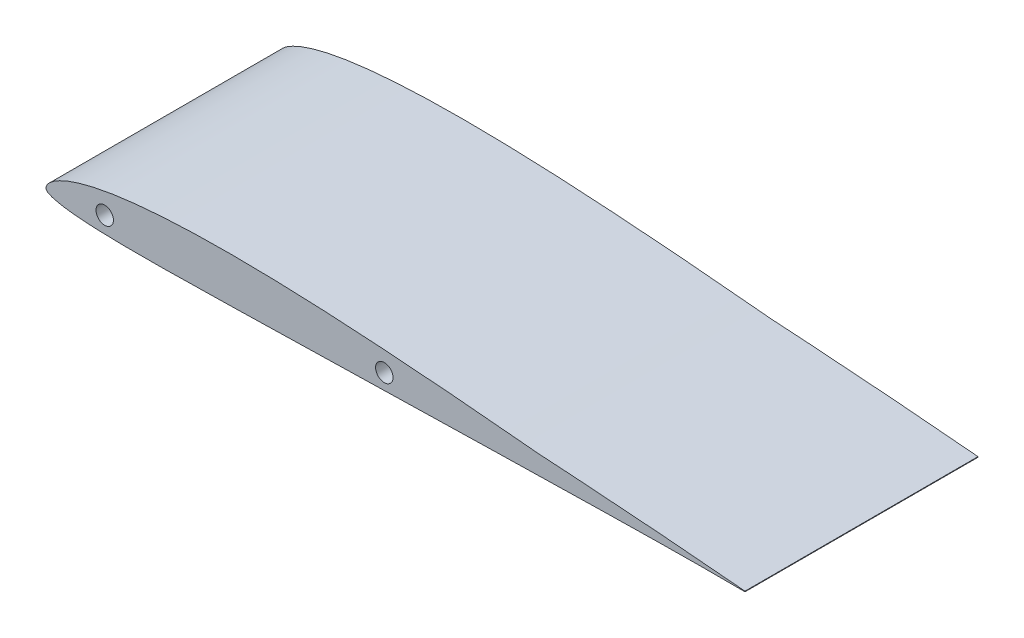
ISO-10303-21;
HEADER;
FILE_DESCRIPTION(('STEP AP214'),'2;1');
FILE_NAME('part.step','',(''),(''),'','','');
FILE_SCHEMA(('AUTOMOTIVE_DESIGN { 1 0 10303 214 1 1 1 1 }'));
ENDSEC;
DATA;
#1=APPLICATION_CONTEXT('core data for automotive mechanical design processes');
#2=APPLICATION_PROTOCOL_DEFINITION('international standard','automotive_design',2000,#1);
#3=PRODUCT_CONTEXT('',#1,'mechanical');
#4=PRODUCT('Part','Part','',(#3));
#5=PRODUCT_RELATED_PRODUCT_CATEGORY('part','',(#4));
#6=PRODUCT_DEFINITION_FORMATION('','',#4);
#7=PRODUCT_DEFINITION_CONTEXT('part definition',#1,'design');
#8=PRODUCT_DEFINITION('design','',#6,#7);
#9=PRODUCT_DEFINITION_SHAPE('','',#8);
#10=(LENGTH_UNIT() NAMED_UNIT(*) SI_UNIT(.MILLI.,.METRE.));
#11=(NAMED_UNIT(*) PLANE_ANGLE_UNIT() SI_UNIT($,.RADIAN.));
#12=(NAMED_UNIT(*) SI_UNIT($,.STERADIAN.) SOLID_ANGLE_UNIT());
#13=UNCERTAINTY_MEASURE_WITH_UNIT(LENGTH_MEASURE(1.E-05),#10,'distance_accuracy_value','');
#14=(GEOMETRIC_REPRESENTATION_CONTEXT(3) GLOBAL_UNCERTAINTY_ASSIGNED_CONTEXT((#13)) GLOBAL_UNIT_ASSIGNED_CONTEXT((#10,
#11,#12)) REPRESENTATION_CONTEXT('',''));
#15=CARTESIAN_POINT('',(0.,0.,0.));
#16=DIRECTION('',(0.,0.,1.));
#17=DIRECTION('',(1.,0.,0.));
#18=AXIS2_PLACEMENT_3D('',#15,#16,#17);
#19=CARTESIAN_POINT('',(64.718169847704,-2.49914341716771,12.7));
#20=CARTESIAN_POINT('',(64.5700863597721,-2.48564719706303,12.7));
#21=CARTESIAN_POINT('',(64.1209098617265,-2.44470958161289,12.7));
#22=CARTESIAN_POINT('',(63.3309207397427,-2.3718990230685,12.7));
#23=CARTESIAN_POINT('',(62.3409883927192,-2.28537082803649,12.7));
#24=CARTESIAN_POINT('',(61.3028582922592,-2.19400634845541,12.7));
#25=CARTESIAN_POINT('',(60.2557497256468,-2.10206121688128,12.7));
#26=CARTESIAN_POINT('',(59.2056408703462,-2.01376111597872,12.7));
#27=CARTESIAN_POINT('',(58.1542987652445,-1.92551778278716,12.7));
#28=CARTESIAN_POINT('',(57.10210369463,-1.83932615902008,12.7));
#29=CARTESIAN_POINT('',(56.0496024680168,-1.75405591693105,12.7));
#30=CARTESIAN_POINT('',(54.9970558416932,-1.67064421515658,12.7));
#31=CARTESIAN_POINT('',(53.9447888784858,-1.58944698577521,12.7));
#32=CARTESIAN_POINT('',(52.8928462193375,-1.50857749435901,12.7));
#33=CARTESIAN_POINT('',(51.8413248451181,-1.43024497139835,12.7));
#34=CARTESIAN_POINT('',(50.790005293002,-1.35278435451261,12.7));
#35=CARTESIAN_POINT('',(49.7392452248386,-1.27679675306078,12.7));
#36=CARTESIAN_POINT('',(48.6886365236809,-1.20292008674714,12.7));
#37=CARTESIAN_POINT('',(47.6385084516488,-1.12943455280381,12.7));
#38=CARTESIAN_POINT('',(46.5885352992949,-1.05798082753844,12.7));
#39=CARTESIAN_POINT('',(45.5389738462594,-0.987918084517423,12.7));
#40=CARTESIAN_POINT('',(44.48952554402,-0.919015021576504,12.7));
#41=CARTESIAN_POINT('',(43.5185697759269,-0.856341225804134,12.7));
#42=CARTESIAN_POINT('',(42.7637179702502,-0.809534692882645,12.7));
#43=CARTESIAN_POINT('',(42.2921134148214,-0.778415281905461,12.7));
#44=CARTESIAN_POINT('',(42.0251029231558,-0.764814001323901,12.7));
#45=CARTESIAN_POINT('',(41.7599003224846,-0.736388121800623,12.7));
#46=CARTESIAN_POINT('',(41.202070401441,-0.684614178846808,12.7));
#47=CARTESIAN_POINT('',(40.3520647525901,-0.602008925329663,12.7));
#48=CARTESIAN_POINT('',(39.4582145568872,-0.518614415079345,12.7));
#49=CARTESIAN_POINT('',(38.6592375717142,-0.444523122096948,12.7));
#50=CARTESIAN_POINT('',(37.9433398350866,-0.378547435901393,12.7));
#51=CARTESIAN_POINT('',(37.0462679682503,-0.297124128931309,12.7));
#52=CARTESIAN_POINT('',(35.9983064528327,-0.203164046184115,12.7));
#53=CARTESIAN_POINT('',(34.928593526426,-0.109310265748228,12.7));
#54=CARTESIAN_POINT('',(33.861679663531,-0.0174387960178162,12.7));
#55=CARTESIAN_POINT('',(32.8559250718614,0.0675724459022536,12.7));
#56=CARTESIAN_POINT('',(31.8665935027641,0.149614420635084,12.7));
#57=CARTESIAN_POINT('',(31.004614735391,0.219417223364439,12.7));
#58=CARTESIAN_POINT('',(30.2931936820511,0.276018623889717,12.7));
#59=CARTESIAN_POINT('',(29.5106377163744,0.337620448810088,12.7));
#60=CARTESIAN_POINT('',(28.6039246993751,0.406949285952623,12.7));
#61=CARTESIAN_POINT('',(27.5491661903885,0.485466539791,12.7));
#62=CARTESIAN_POINT('',(26.4951038836468,0.561602221713484,12.7));
#63=CARTESIAN_POINT('',(25.0903538325768,0.659252902555274,12.7));
#64=CARTESIAN_POINT('',(23.6857592770532,0.751291384874744,12.7));
#65=CARTESIAN_POINT('',(22.2814483747201,0.837223705272189,12.7));
#66=CARTESIAN_POINT('',(21.2284631307385,0.898255328243809,12.7));
#67=CARTESIAN_POINT('',(19.8248604979235,0.975033120566874,12.7));
#68=CARTESIAN_POINT('',(18.4214009175996,1.04443600676965,12.7));
#69=CARTESIAN_POINT('',(17.018020949118,1.10570003905108,12.7));
#70=CARTESIAN_POINT('',(15.9658553470024,1.14762054178324,12.7));
#71=CARTESIAN_POINT('',(14.9139278238915,1.18459962095718,12.7));
#72=CARTESIAN_POINT('',(13.8623101202811,1.21689788380779,12.7));
#73=CARTESIAN_POINT('',(12.8111474923641,1.24413592674671,12.7));
#74=CARTESIAN_POINT('',(11.7604931763912,1.26613396165535,12.7));
#75=CARTESIAN_POINT('',(10.7103646107296,1.28210253460065,12.7));
#76=CARTESIAN_POINT('',(9.66077054699325,1.29226212707483,12.7));
#77=CARTESIAN_POINT('',(8.61180432065277,1.29556733331623,12.7));
#78=CARTESIAN_POINT('',(7.56374854456024,1.29185480024869,12.7));
#79=CARTESIAN_POINT('',(6.51672895722965,1.28056388757099,12.7));
#80=CARTESIAN_POINT('',(5.47099306506855,1.2613206982778,12.7));
#81=CARTESIAN_POINT('',(4.42669753924762,1.23307593202537,12.7));
#82=CARTESIAN_POINT('',(3.38424374077372,1.19526201265927,12.7));
#83=CARTESIAN_POINT('',(2.34415499897872,1.14711854551285,12.7));
#84=CARTESIAN_POINT('',(1.30677498982993,1.0874054614982,12.7));
#85=CARTESIAN_POINT('',(0.272951001820169,1.01553077028358,12.7));
#86=CARTESIAN_POINT('',(-0.756620414487699,0.929630454225497,12.7));
#87=CARTESIAN_POINT('',(-1.78099536668029,0.828802249262063,12.7));
#88=CARTESIAN_POINT('',(-2.79849680116625,0.710716889741845,12.7));
#89=CARTESIAN_POINT('',(-3.80764376873832,0.57400051898315,12.7));
#90=CARTESIAN_POINT('',(-4.80548348146486,0.415836093956562,12.7));
#91=CARTESIAN_POINT('',(-5.78919602732389,0.233022374985238,12.7));
#92=CARTESIAN_POINT('',(-6.75322882298853,0.0219551455858673,12.7));
#93=CARTESIAN_POINT('',(-7.68882740701967,-0.221784243972986,12.7));
#94=CARTESIAN_POINT('',(-8.57880385771648,-0.50007433707202,12.7));
#95=CARTESIAN_POINT('',(-9.39012863230739,-0.81024108977543,12.7));
#96=CARTESIAN_POINT('',(-10.075256248664,-1.13552580178097,12.7));
#97=CARTESIAN_POINT('',(-10.5975297279463,-1.44827929438076,12.7));
#98=CARTESIAN_POINT('',(-10.9578316717469,-1.7223556968941,12.7));
#99=CARTESIAN_POINT('',(-11.1917380154902,-1.94953529856151,12.7));
#100=CARTESIAN_POINT('',(-11.3405099092005,-2.13792559128003,12.7));
#101=CARTESIAN_POINT('',(-11.4306189317464,-2.29813577154256,12.7));
#102=CARTESIAN_POINT('',(-11.4762632766858,-2.43574472752276,12.7));
#103=CARTESIAN_POINT('',(-11.4867577487306,-2.55694348149571,12.7));
#104=CARTESIAN_POINT('',(-11.4605700807749,-2.67120322013189,12.7));
#105=CARTESIAN_POINT('',(-11.385368171073,-2.78094718028074,12.7));
#106=CARTESIAN_POINT('',(-11.2527233617712,-2.87862873225569,12.7));
#107=CARTESIAN_POINT('',(-11.0603639476411,-2.97798998195567,12.7));
#108=CARTESIAN_POINT('',(-10.777566167535,-3.08518783465535,12.7));
#109=CARTESIAN_POINT('',(-10.357827971838,-3.20445295913348,12.7));
#110=CARTESIAN_POINT('',(-9.76381890958835,-3.32633068265198,12.7));
#111=CARTESIAN_POINT('',(-9.00133133853954,-3.43994074789566,12.7));
#112=CARTESIAN_POINT('',(-8.11656677105108,-3.53408415799054,12.7));
#113=CARTESIAN_POINT('',(-7.16369450703863,-3.60653792711495,12.7));
#114=CARTESIAN_POINT('',(-6.17661003897358,-3.66021544640004,12.7));
#115=CARTESIAN_POINT('',(-5.17096951773806,-3.69830683103782,12.7));
#116=CARTESIAN_POINT('',(-4.15357358196951,-3.72418070511725,12.7));
#117=CARTESIAN_POINT('',(-3.1279953713106,-3.74066182843254,12.7));
#118=CARTESIAN_POINT('',(-2.09644655939784,-3.74963534499413,12.7));
#119=CARTESIAN_POINT('',(-1.06023545727153,-3.75244576142976,12.7));
#120=CARTESIAN_POINT('',(-0.0204745839777511,-3.74952557809699,12.7));
#121=CARTESIAN_POINT('',(1.02227704483117,-3.74189641767998,12.7));
#122=CARTESIAN_POINT('',(2.0673129921882,-3.73049235181645,12.7));
#123=CARTESIAN_POINT('',(3.11442633700978,-3.71562183791468,12.7));
#124=CARTESIAN_POINT('',(4.16339384741037,-3.69825113532567,12.7));
#125=CARTESIAN_POINT('',(5.21451869845059,-3.67878705728121,12.7));
#126=CARTESIAN_POINT('',(6.26780604719807,-3.65786316275959,12.7));
#127=CARTESIAN_POINT('',(7.32337012608414,-3.63531138056317,12.7));
#128=CARTESIAN_POINT('',(8.38120895078131,-3.61244283585685,12.7));
#129=CARTESIAN_POINT('',(9.4415265542918,-3.58839107980679,12.7));
#130=CARTESIAN_POINT('',(10.5041586324956,-3.56390505616268,12.7));
#131=CARTESIAN_POINT('',(11.9246828099837,-3.53089198264095,12.7));
#132=CARTESIAN_POINT('',(13.3472542953612,-3.49719620870567,12.7));
#133=CARTESIAN_POINT('',(14.7715332136547,-3.46358840842327,12.7));
#134=CARTESIAN_POINT('',(15.8413066340253,-3.43840949240457,12.7));
#135=CARTESIAN_POINT('',(16.9119898284657,-3.41303446745289,12.7));
#136=CARTESIAN_POINT('',(17.9837204113314,-3.38788803059185,12.7));
#137=CARTESIAN_POINT('',(19.0566380233557,-3.36250475696749,12.7));
#138=CARTESIAN_POINT('',(20.130171202299,-3.33742587119402,12.7));
#139=CARTESIAN_POINT('',(21.203624946033,-3.31233631094241,12.7));
#140=CARTESIAN_POINT('',(22.2763416106558,-3.28737716441832,12.7));
#141=CARTESIAN_POINT('',(23.3483791945945,-3.26281140214925,12.7));
#142=CARTESIAN_POINT('',(24.4197690673016,-3.23787116470835,12.7));
#143=CARTESIAN_POINT('',(25.4904600033827,-3.21361684682983,12.7));
#144=CARTESIAN_POINT('',(26.5603563654065,-3.18930259377939,12.7));
#145=CARTESIAN_POINT('',(27.6295478282036,-3.16539472920689,12.7));
#146=CARTESIAN_POINT('',(28.6982745252622,-3.14130260404137,12.7));
#147=CARTESIAN_POINT('',(29.6029991912298,-3.12120163212048,12.7));
#148=CARTESIAN_POINT('',(30.6578396186762,-3.09785324123607,12.7));
#149=CARTESIAN_POINT('',(31.6984968307348,-3.07438532495455,12.7));
#150=CARTESIAN_POINT('',(32.8815561505967,-3.04817804892334,12.7));
#151=CARTESIAN_POINT('',(33.9112486650547,-3.02532762188314,12.7));
#152=CARTESIAN_POINT('',(34.9444396241889,-3.00209816144667,12.7));
#153=CARTESIAN_POINT('',(35.9883562794765,-2.97897448250889,12.7));
#154=CARTESIAN_POINT('',(36.9227455666414,-2.95827576657659,12.7));
#155=CARTESIAN_POINT('',(37.7408028427932,-2.94024274924529,12.7));
#156=CARTESIAN_POINT('',(38.4318881210328,-2.92519934612656,12.7));
#157=CARTESIAN_POINT('',(39.2268289431705,-2.90776490864207,12.7));
#158=CARTESIAN_POINT('',(40.1398592648068,-2.88809299334055,12.7));
#159=CARTESIAN_POINT('',(40.9835431493373,-2.86981087351961,12.7));
#160=CARTESIAN_POINT('',(41.555453589827,-2.85776196386855,12.7));
#161=CARTESIAN_POINT('',(41.8328169631033,-2.85171870493795,12.7));
#162=CARTESIAN_POINT('',(42.0685123647631,-2.84722038867814,12.7));
#163=CARTESIAN_POINT('',(42.5469622386251,-2.83667981059068,12.7));
#164=CARTESIAN_POINT('',(43.3252210310109,-2.82046057913884,12.7));
#165=CARTESIAN_POINT('',(44.3481287880807,-2.79909650410675,12.7));
#166=CARTESIAN_POINT('',(45.4045645465518,-2.77735138711907,12.7));
#167=CARTESIAN_POINT('',(46.4604457405937,-2.75609574552365,12.7));
#168=CARTESIAN_POINT('',(47.5160407585526,-2.73480733519798,12.7));
#169=CARTESIAN_POINT('',(48.571770090585,-2.71411617809866,12.7));
#170=CARTESIAN_POINT('',(49.6276684114623,-2.69332845799193,12.7));
#171=CARTESIAN_POINT('',(50.6838261949974,-2.67327726682487,12.7));
#172=CARTESIAN_POINT('',(51.7401266355024,-2.6535772359286,12.7));
#173=CARTESIAN_POINT('',(52.7967214193395,-2.63583861409836,12.7));
#174=CARTESIAN_POINT('',(54.2058445534349,-2.61343635874188,12.7));
#175=CARTESIAN_POINT('',(55.6154466571646,-2.59433613008525,12.7));
#176=CARTESIAN_POINT('',(57.0251842731443,-2.57829443287762,12.7));
#177=CARTESIAN_POINT('',(58.0829203562666,-2.5686777071313,12.7));
#178=CARTESIAN_POINT('',(59.1407026315371,-2.56064162571556,12.7));
#179=CARTESIAN_POINT('',(60.1987430577513,-2.55531844649266,12.7));
#180=CARTESIAN_POINT('',(61.2562747363152,-2.55264426885665,12.7));
#181=CARTESIAN_POINT('',(62.3070531352774,-2.55221377456605,12.7));
#182=CARTESIAN_POINT('',(63.3104787873987,-2.55635305285632,12.7));
#183=CARTESIAN_POINT('',(64.1121021333313,-2.560000456598,12.7));
#184=CARTESIAN_POINT('',(64.5678273398327,-2.5625989734995,12.7));
#185=CARTESIAN_POINT('',(64.718169847704,-2.56345621716771,12.7));
#186=B_SPLINE_CURVE_WITH_KNOTS('',3,(#19,#20,#21,#22,#23,#24,#25,#26,#27,#28,#29,#30,#31,#32,
#33,#34,#35,#36,#37,#38,#39,#40,#41,#42,#43,#44,#45,#46,#47,#48,#49,#50,#51,#52,#53,#54,#55,#56,
#57,#58,#59,#60,#61,#62,#63,#64,#65,#66,#67,#68,#69,#70,#71,#72,#73,#74,#75,#76,#77,#78,#79,#80,
#81,#82,#83,#84,#85,#86,#87,#88,#89,#90,#91,#92,#93,#94,#95,#96,#97,#98,#99,#100,#101,#102,#103,
#104,#105,#106,#107,#108,#109,#110,#111,#112,#113,#114,#115,#116,#117,#118,#119,#120,#121,#122,
#123,#124,#125,#126,#127,#128,#129,#130,#131,#132,#133,#134,#135,#136,#137,#138,#139,#140,#141,
#142,#143,#144,#145,#146,#147,#148,#149,#150,#151,#152,#153,#154,#155,#156,#157,#158,#159,#160,
#161,#162,#163,#164,#165,#166,#167,#168,#169,#170,#171,#172,#173,#174,#175,#176,#177,#178,#179,
#180,#181,#182,#183,#184,#185),.UNSPECIFIED.,.F.,.F.,(4,1,1,1,1,1,1,1,1,1,1,1,1,1,1,1,1,1,1,1,1,
1,1,1,1,1,1,1,1,1,1,1,1,1,1,1,1,1,1,1,1,1,1,1,1,1,1,1,1,1,1,1,1,1,1,1,1,1,1,1,1,1,1,1,1,1,1,1,1,
1,1,1,1,1,1,1,1,1,1,1,1,1,1,1,1,1,1,1,1,1,1,1,1,1,1,1,1,1,1,1,1,1,1,1,1,1,1,1,1,1,1,1,1,1,1,1,1,
1,1,1,1,1,1,1,1,1,1,1,1,1,1,1,1,1,1,1,1,1,1,1,1,1,1,1,1,1,1,1,1,1,1,1,1,1,1,1,1,1,1,1,1,1,1,1,
4),(0.,0.00290099659372873,0.00879949215818137,0.0154775211449576,0.0222875942353728,
0.0291311059359383,0.0359845727886083,0.0428468815231683,0.0497142979882809,0.0565810302604014,
0.0634478411876994,0.0703132293701872,0.0771711678945666,0.0840311741497836,0.090884627100437,
0.0977373955031283,0.10458440936198,0.111431995724545,0.118274877415409,0.125116136448488,
0.131953904848395,0.13879304095194,0.144098462846876,0.146708547028149,0.148014315644422,
0.149313146551483,0.151910855866899,0.15894466195637,0.165973894108373,0.169425197998219,
0.174599098038009,0.179999827222256,0.186998483896338,0.195126221538068,0.200949456634637,
0.207890370980172,0.214817865515354,0.22031697801188,0.224762113608554,0.228741131521326,
0.235631413074054,0.24250316876118,0.24937577864735,0.256249105242001,0.269975124298455,
0.276837253986749,0.283697593009064,0.290552692507618,0.30426160656467,0.311111522811174,
0.317957828523149,0.324804965375357,0.331646617506474,0.338483878107494,0.345319338276512,
0.352148660719282,0.358973534693761,0.365797142126222,0.372613328234074,0.37942045451472,
0.386224884987997,0.393018255101135,0.399801225843235,0.406575620561957,0.41333111749985,
0.420072961630209,0.426793048043559,0.433486562415399,0.440153627327362,0.4467760361761,
0.453352888479925,0.459861970007757,0.466293611508859,0.472602109032427,0.478718386362554,
0.484476600917274,0.489534096861973,0.493495638696748,0.496331130758294,0.498346313282037,
0.499841011263958,0.500999223663144,0.501914653491868,0.502649229242367,0.503345398266634,
0.50415780520335,0.505185160296857,0.506525739891464,0.508375842410537,0.511073874727062,
0.515031356802908,0.520196696865689,0.526108614995491,0.532386125291835,0.538838474427164,
0.545393384701584,0.552018992727712,0.558693317056157,0.565404176163481,0.572144526051526,
0.578909154577512,0.585689295212745,0.592488493333882,0.59929836847987,0.606119896932364,
0.612956027325966,0.619808706789196,0.62667296427988,0.633554161890214,0.640451344600834,
0.647364459483236,0.654290996191379,0.668172423609916,0.675125781726664,0.682085580061521,
0.689048857897814,0.696020050472818,0.703000171948541,0.709986710377743,0.716969769396795,
0.723948346696876,0.73092044933395,0.737890086365544,0.744856198708493,0.751814361966286,
0.758768528400392,0.765720713177421,0.772669892235555,0.776423533560404,0.786305074021238,
0.792977667356492,0.799509991668968,0.806398718942054,0.813139712830137,0.819881191153094,
0.824632580087798,0.829103409178679,0.833367054905999,0.840145140127739,0.846920231426965,
0.849830696568046,0.851305256070526,0.85233270963581,0.854429810086703,0.860641790464031,
0.867519382964738,0.874390493827504,0.881256599829939,0.888123181315473,0.894988722653487,
0.901857217200624,0.908727131150569,0.915597457074931,0.922468598797302,0.929343574538009,
0.943092095045522,0.949971603935152,0.956848493312481,0.963728748261155,0.970608901330828,
0.977490476697614,0.984360631540857,0.991108923943024,0.997066858157041,1.),.UNSPECIFIED.);
#187=DIRECTION('',(0.,0.,-1.));
#188=VECTOR('',#187,1.);
#189=SURFACE_OF_LINEAR_EXTRUSION('',#186,#188);
#190=CARTESIAN_POINT('',(64.718169847704,-2.49914341716771,-12.7));
#191=CARTESIAN_POINT('',(64.5700863597721,-2.48564719706303,-12.7));
#192=CARTESIAN_POINT('',(64.1209098617265,-2.44470958161289,-12.7));
#193=CARTESIAN_POINT('',(63.3309207397427,-2.3718990230685,-12.7));
#194=CARTESIAN_POINT('',(62.3409883927192,-2.28537082803649,-12.7));
#195=CARTESIAN_POINT('',(61.3028582922592,-2.19400634845541,-12.7));
#196=CARTESIAN_POINT('',(60.2557497256468,-2.10206121688128,-12.7));
#197=CARTESIAN_POINT('',(59.2056408703462,-2.01376111597872,-12.7));
#198=CARTESIAN_POINT('',(58.1542987652445,-1.92551778278716,-12.7));
#199=CARTESIAN_POINT('',(57.10210369463,-1.83932615902008,-12.7));
#200=CARTESIAN_POINT('',(56.0496024680168,-1.75405591693105,-12.7));
#201=CARTESIAN_POINT('',(54.9970558416932,-1.67064421515658,-12.7));
#202=CARTESIAN_POINT('',(53.9447888784858,-1.58944698577521,-12.7));
#203=CARTESIAN_POINT('',(52.8928462193375,-1.50857749435901,-12.7));
#204=CARTESIAN_POINT('',(51.8413248451181,-1.43024497139835,-12.7));
#205=CARTESIAN_POINT('',(50.790005293002,-1.35278435451261,-12.7));
#206=CARTESIAN_POINT('',(49.7392452248386,-1.27679675306078,-12.7));
#207=CARTESIAN_POINT('',(48.6886365236809,-1.20292008674714,-12.7));
#208=CARTESIAN_POINT('',(47.6385084516488,-1.12943455280381,-12.7));
#209=CARTESIAN_POINT('',(46.5885352992949,-1.05798082753844,-12.7));
#210=CARTESIAN_POINT('',(45.5389738462594,-0.987918084517423,-12.7));
#211=CARTESIAN_POINT('',(44.48952554402,-0.919015021576504,-12.7));
#212=CARTESIAN_POINT('',(43.5185697759269,-0.856341225804134,-12.7));
#213=CARTESIAN_POINT('',(42.7637179702502,-0.809534692882645,-12.7));
#214=CARTESIAN_POINT('',(42.2921134148214,-0.778415281905461,-12.7));
#215=CARTESIAN_POINT('',(42.0251029231558,-0.764814001323901,-12.7));
#216=CARTESIAN_POINT('',(41.7599003224846,-0.736388121800623,-12.7));
#217=CARTESIAN_POINT('',(41.202070401441,-0.684614178846808,-12.7));
#218=CARTESIAN_POINT('',(40.3520647525901,-0.602008925329663,-12.7));
#219=CARTESIAN_POINT('',(39.4582145568872,-0.518614415079345,-12.7));
#220=CARTESIAN_POINT('',(38.6592375717142,-0.444523122096948,-12.7));
#221=CARTESIAN_POINT('',(37.9433398350866,-0.378547435901393,-12.7));
#222=CARTESIAN_POINT('',(37.0462679682503,-0.297124128931309,-12.7));
#223=CARTESIAN_POINT('',(35.9983064528327,-0.203164046184115,-12.7));
#224=CARTESIAN_POINT('',(34.928593526426,-0.109310265748228,-12.7));
#225=CARTESIAN_POINT('',(33.861679663531,-0.0174387960178162,-12.7));
#226=CARTESIAN_POINT('',(32.8559250718614,0.0675724459022536,-12.7));
#227=CARTESIAN_POINT('',(31.8665935027641,0.149614420635084,-12.7));
#228=CARTESIAN_POINT('',(31.004614735391,0.219417223364439,-12.7));
#229=CARTESIAN_POINT('',(30.2931936820511,0.276018623889717,-12.7));
#230=CARTESIAN_POINT('',(29.5106377163744,0.337620448810088,-12.7));
#231=CARTESIAN_POINT('',(28.6039246993751,0.406949285952623,-12.7));
#232=CARTESIAN_POINT('',(27.5491661903885,0.485466539791,-12.7));
#233=CARTESIAN_POINT('',(26.4951038836468,0.561602221713484,-12.7));
#234=CARTESIAN_POINT('',(25.0903538325768,0.659252902555274,-12.7));
#235=CARTESIAN_POINT('',(23.6857592770532,0.751291384874744,-12.7));
#236=CARTESIAN_POINT('',(22.2814483747201,0.837223705272189,-12.7));
#237=CARTESIAN_POINT('',(21.2284631307385,0.898255328243809,-12.7));
#238=CARTESIAN_POINT('',(19.8248604979235,0.975033120566874,-12.7));
#239=CARTESIAN_POINT('',(18.4214009175996,1.04443600676965,-12.7));
#240=CARTESIAN_POINT('',(17.018020949118,1.10570003905108,-12.7));
#241=CARTESIAN_POINT('',(15.9658553470024,1.14762054178324,-12.7));
#242=CARTESIAN_POINT('',(14.9139278238915,1.18459962095718,-12.7));
#243=CARTESIAN_POINT('',(13.8623101202811,1.21689788380779,-12.7));
#244=CARTESIAN_POINT('',(12.8111474923641,1.24413592674671,-12.7));
#245=CARTESIAN_POINT('',(11.7604931763912,1.26613396165535,-12.7));
#246=CARTESIAN_POINT('',(10.7103646107296,1.28210253460065,-12.7));
#247=CARTESIAN_POINT('',(9.66077054699325,1.29226212707483,-12.7));
#248=CARTESIAN_POINT('',(8.61180432065277,1.29556733331623,-12.7));
#249=CARTESIAN_POINT('',(7.56374854456024,1.29185480024869,-12.7));
#250=CARTESIAN_POINT('',(6.51672895722965,1.28056388757099,-12.7));
#251=CARTESIAN_POINT('',(5.47099306506855,1.2613206982778,-12.7));
#252=CARTESIAN_POINT('',(4.42669753924762,1.23307593202537,-12.7));
#253=CARTESIAN_POINT('',(3.38424374077372,1.19526201265927,-12.7));
#254=CARTESIAN_POINT('',(2.34415499897872,1.14711854551285,-12.7));
#255=CARTESIAN_POINT('',(1.30677498982993,1.0874054614982,-12.7));
#256=CARTESIAN_POINT('',(0.272951001820169,1.01553077028358,-12.7));
#257=CARTESIAN_POINT('',(-0.756620414487699,0.929630454225497,-12.7));
#258=CARTESIAN_POINT('',(-1.78099536668029,0.828802249262063,-12.7));
#259=CARTESIAN_POINT('',(-2.79849680116625,0.710716889741845,-12.7));
#260=CARTESIAN_POINT('',(-3.80764376873832,0.57400051898315,-12.7));
#261=CARTESIAN_POINT('',(-4.80548348146486,0.415836093956562,-12.7));
#262=CARTESIAN_POINT('',(-5.78919602732389,0.233022374985238,-12.7));
#263=CARTESIAN_POINT('',(-6.75322882298853,0.0219551455858673,-12.7));
#264=CARTESIAN_POINT('',(-7.68882740701967,-0.221784243972986,-12.7));
#265=CARTESIAN_POINT('',(-8.57880385771648,-0.50007433707202,-12.7));
#266=CARTESIAN_POINT('',(-9.39012863230739,-0.81024108977543,-12.7));
#267=CARTESIAN_POINT('',(-10.075256248664,-1.13552580178097,-12.7));
#268=CARTESIAN_POINT('',(-10.5975297279463,-1.44827929438076,-12.7));
#269=CARTESIAN_POINT('',(-10.9578316717469,-1.7223556968941,-12.7));
#270=CARTESIAN_POINT('',(-11.1917380154902,-1.94953529856151,-12.7));
#271=CARTESIAN_POINT('',(-11.3405099092005,-2.13792559128003,-12.7));
#272=CARTESIAN_POINT('',(-11.4306189317464,-2.29813577154256,-12.7));
#273=CARTESIAN_POINT('',(-11.4762632766858,-2.43574472752276,-12.7));
#274=CARTESIAN_POINT('',(-11.4867577487306,-2.55694348149571,-12.7));
#275=CARTESIAN_POINT('',(-11.4605700807749,-2.67120322013189,-12.7));
#276=CARTESIAN_POINT('',(-11.385368171073,-2.78094718028074,-12.7));
#277=CARTESIAN_POINT('',(-11.2527233617712,-2.87862873225569,-12.7));
#278=CARTESIAN_POINT('',(-11.0603639476411,-2.97798998195567,-12.7));
#279=CARTESIAN_POINT('',(-10.777566167535,-3.08518783465535,-12.7));
#280=CARTESIAN_POINT('',(-10.357827971838,-3.20445295913348,-12.7));
#281=CARTESIAN_POINT('',(-9.76381890958835,-3.32633068265198,-12.7));
#282=CARTESIAN_POINT('',(-9.00133133853954,-3.43994074789566,-12.7));
#283=CARTESIAN_POINT('',(-8.11656677105108,-3.53408415799054,-12.7));
#284=CARTESIAN_POINT('',(-7.16369450703863,-3.60653792711495,-12.7));
#285=CARTESIAN_POINT('',(-6.17661003897358,-3.66021544640004,-12.7));
#286=CARTESIAN_POINT('',(-5.17096951773806,-3.69830683103782,-12.7));
#287=CARTESIAN_POINT('',(-4.15357358196951,-3.72418070511725,-12.7));
#288=CARTESIAN_POINT('',(-3.1279953713106,-3.74066182843254,-12.7));
#289=CARTESIAN_POINT('',(-2.09644655939784,-3.74963534499413,-12.7));
#290=CARTESIAN_POINT('',(-1.06023545727153,-3.75244576142976,-12.7));
#291=CARTESIAN_POINT('',(-0.0204745839777511,-3.74952557809699,-12.7));
#292=CARTESIAN_POINT('',(1.02227704483117,-3.74189641767998,-12.7));
#293=CARTESIAN_POINT('',(2.0673129921882,-3.73049235181645,-12.7));
#294=CARTESIAN_POINT('',(3.11442633700978,-3.71562183791468,-12.7));
#295=CARTESIAN_POINT('',(4.16339384741037,-3.69825113532567,-12.7));
#296=CARTESIAN_POINT('',(5.21451869845059,-3.67878705728121,-12.7));
#297=CARTESIAN_POINT('',(6.26780604719807,-3.65786316275959,-12.7));
#298=CARTESIAN_POINT('',(7.32337012608414,-3.63531138056317,-12.7));
#299=CARTESIAN_POINT('',(8.38120895078131,-3.61244283585685,-12.7));
#300=CARTESIAN_POINT('',(9.4415265542918,-3.58839107980679,-12.7));
#301=CARTESIAN_POINT('',(10.5041586324956,-3.56390505616268,-12.7));
#302=CARTESIAN_POINT('',(11.9246828099837,-3.53089198264095,-12.7));
#303=CARTESIAN_POINT('',(13.3472542953612,-3.49719620870567,-12.7));
#304=CARTESIAN_POINT('',(14.7715332136547,-3.46358840842327,-12.7));
#305=CARTESIAN_POINT('',(15.8413066340253,-3.43840949240457,-12.7));
#306=CARTESIAN_POINT('',(16.9119898284657,-3.41303446745289,-12.7));
#307=CARTESIAN_POINT('',(17.9837204113314,-3.38788803059185,-12.7));
#308=CARTESIAN_POINT('',(19.0566380233557,-3.36250475696749,-12.7));
#309=CARTESIAN_POINT('',(20.130171202299,-3.33742587119402,-12.7));
#310=CARTESIAN_POINT('',(21.203624946033,-3.31233631094241,-12.7));
#311=CARTESIAN_POINT('',(22.2763416106558,-3.28737716441832,-12.7));
#312=CARTESIAN_POINT('',(23.3483791945945,-3.26281140214925,-12.7));
#313=CARTESIAN_POINT('',(24.4197690673016,-3.23787116470835,-12.7));
#314=CARTESIAN_POINT('',(25.4904600033827,-3.21361684682983,-12.7));
#315=CARTESIAN_POINT('',(26.5603563654065,-3.18930259377939,-12.7));
#316=CARTESIAN_POINT('',(27.6295478282036,-3.16539472920689,-12.7));
#317=CARTESIAN_POINT('',(28.6982745252622,-3.14130260404137,-12.7));
#318=CARTESIAN_POINT('',(29.6029991912298,-3.12120163212048,-12.7));
#319=CARTESIAN_POINT('',(30.6578396186762,-3.09785324123607,-12.7));
#320=CARTESIAN_POINT('',(31.6984968307348,-3.07438532495455,-12.7));
#321=CARTESIAN_POINT('',(32.8815561505967,-3.04817804892334,-12.7));
#322=CARTESIAN_POINT('',(33.9112486650547,-3.02532762188314,-12.7));
#323=CARTESIAN_POINT('',(34.9444396241889,-3.00209816144667,-12.7));
#324=CARTESIAN_POINT('',(35.9883562794765,-2.97897448250889,-12.7));
#325=CARTESIAN_POINT('',(36.9227455666414,-2.95827576657659,-12.7));
#326=CARTESIAN_POINT('',(37.7408028427932,-2.94024274924529,-12.7));
#327=CARTESIAN_POINT('',(38.4318881210328,-2.92519934612656,-12.7));
#328=CARTESIAN_POINT('',(39.2268289431705,-2.90776490864207,-12.7));
#329=CARTESIAN_POINT('',(40.1398592648068,-2.88809299334055,-12.7));
#330=CARTESIAN_POINT('',(40.9835431493373,-2.86981087351961,-12.7));
#331=CARTESIAN_POINT('',(41.555453589827,-2.85776196386855,-12.7));
#332=CARTESIAN_POINT('',(41.8328169631033,-2.85171870493795,-12.7));
#333=CARTESIAN_POINT('',(42.0685123647631,-2.84722038867814,-12.7));
#334=CARTESIAN_POINT('',(42.5469622386251,-2.83667981059068,-12.7));
#335=CARTESIAN_POINT('',(43.3252210310109,-2.82046057913884,-12.7));
#336=CARTESIAN_POINT('',(44.3481287880807,-2.79909650410675,-12.7));
#337=CARTESIAN_POINT('',(45.4045645465518,-2.77735138711907,-12.7));
#338=CARTESIAN_POINT('',(46.4604457405937,-2.75609574552365,-12.7));
#339=CARTESIAN_POINT('',(47.5160407585526,-2.73480733519798,-12.7));
#340=CARTESIAN_POINT('',(48.571770090585,-2.71411617809866,-12.7));
#341=CARTESIAN_POINT('',(49.6276684114623,-2.69332845799193,-12.7));
#342=CARTESIAN_POINT('',(50.6838261949974,-2.67327726682487,-12.7));
#343=CARTESIAN_POINT('',(51.7401266355024,-2.6535772359286,-12.7));
#344=CARTESIAN_POINT('',(52.7967214193395,-2.63583861409836,-12.7));
#345=CARTESIAN_POINT('',(54.2058445534349,-2.61343635874188,-12.7));
#346=CARTESIAN_POINT('',(55.6154466571646,-2.59433613008525,-12.7));
#347=CARTESIAN_POINT('',(57.0251842731443,-2.57829443287762,-12.7));
#348=CARTESIAN_POINT('',(58.0829203562666,-2.5686777071313,-12.7));
#349=CARTESIAN_POINT('',(59.1407026315371,-2.56064162571556,-12.7));
#350=CARTESIAN_POINT('',(60.1987430577513,-2.55531844649266,-12.7));
#351=CARTESIAN_POINT('',(61.2562747363152,-2.55264426885665,-12.7));
#352=CARTESIAN_POINT('',(62.3070531352774,-2.55221377456605,-12.7));
#353=CARTESIAN_POINT('',(63.3104787873987,-2.55635305285632,-12.7));
#354=CARTESIAN_POINT('',(64.1121021333313,-2.560000456598,-12.7));
#355=CARTESIAN_POINT('',(64.5678273398327,-2.5625989734995,-12.7));
#356=CARTESIAN_POINT('',(64.718169847704,-2.56345621716771,-12.7));
#357=B_SPLINE_CURVE_WITH_KNOTS('',3,(#190,#191,#192,#193,#194,#195,#196,#197,#198,#199,#200,
#201,#202,#203,#204,#205,#206,#207,#208,#209,#210,#211,#212,#213,#214,#215,#216,#217,#218,#219,
#220,#221,#222,#223,#224,#225,#226,#227,#228,#229,#230,#231,#232,#233,#234,#235,#236,#237,#238,
#239,#240,#241,#242,#243,#244,#245,#246,#247,#248,#249,#250,#251,#252,#253,#254,#255,#256,#257,
#258,#259,#260,#261,#262,#263,#264,#265,#266,#267,#268,#269,#270,#271,#272,#273,#274,#275,#276,
#277,#278,#279,#280,#281,#282,#283,#284,#285,#286,#287,#288,#289,#290,#291,#292,#293,#294,#295,
#296,#297,#298,#299,#300,#301,#302,#303,#304,#305,#306,#307,#308,#309,#310,#311,#312,#313,#314,
#315,#316,#317,#318,#319,#320,#321,#322,#323,#324,#325,#326,#327,#328,#329,#330,#331,#332,#333,
#334,#335,#336,#337,#338,#339,#340,#341,#342,#343,#344,#345,#346,#347,#348,#349,#350,#351,#352,
#353,#354,#355,#356),.UNSPECIFIED.,.F.,.F.,(4,1,1,1,1,1,1,1,1,1,1,1,1,1,1,1,1,1,1,1,1,1,1,1,1,1,
1,1,1,1,1,1,1,1,1,1,1,1,1,1,1,1,1,1,1,1,1,1,1,1,1,1,1,1,1,1,1,1,1,1,1,1,1,1,1,1,1,1,1,1,1,1,1,1,
1,1,1,1,1,1,1,1,1,1,1,1,1,1,1,1,1,1,1,1,1,1,1,1,1,1,1,1,1,1,1,1,1,1,1,1,1,1,1,1,1,1,1,1,1,1,1,1,
1,1,1,1,1,1,1,1,1,1,1,1,1,1,1,1,1,1,1,1,1,1,1,1,1,1,1,1,1,1,1,1,1,1,1,1,1,1,1,1,1,1,4),(0.,
0.00290099659372873,0.00879949215818137,0.0154775211449576,0.0222875942353728,
0.0291311059359383,0.0359845727886083,0.0428468815231683,0.0497142979882809,0.0565810302604014,
0.0634478411876994,0.0703132293701872,0.0771711678945666,0.0840311741497836,0.090884627100437,
0.0977373955031283,0.10458440936198,0.111431995724545,0.118274877415409,0.125116136448488,
0.131953904848395,0.13879304095194,0.144098462846876,0.146708547028149,0.148014315644422,
0.149313146551483,0.151910855866899,0.15894466195637,0.165973894108373,0.169425197998219,
0.174599098038009,0.179999827222256,0.186998483896338,0.195126221538068,0.200949456634637,
0.207890370980172,0.214817865515354,0.22031697801188,0.224762113608554,0.228741131521326,
0.235631413074054,0.24250316876118,0.24937577864735,0.256249105242001,0.269975124298455,
0.276837253986749,0.283697593009064,0.290552692507618,0.30426160656467,0.311111522811174,
0.317957828523149,0.324804965375357,0.331646617506474,0.338483878107494,0.345319338276512,
0.352148660719282,0.358973534693761,0.365797142126222,0.372613328234074,0.37942045451472,
0.386224884987997,0.393018255101135,0.399801225843235,0.406575620561957,0.41333111749985,
0.420072961630209,0.426793048043559,0.433486562415399,0.440153627327362,0.4467760361761,
0.453352888479925,0.459861970007757,0.466293611508859,0.472602109032427,0.478718386362554,
0.484476600917274,0.489534096861973,0.493495638696748,0.496331130758294,0.498346313282037,
0.499841011263958,0.500999223663144,0.501914653491868,0.502649229242367,0.503345398266634,
0.50415780520335,0.505185160296857,0.506525739891464,0.508375842410537,0.511073874727062,
0.515031356802908,0.520196696865689,0.526108614995491,0.532386125291835,0.538838474427164,
0.545393384701584,0.552018992727712,0.558693317056157,0.565404176163481,0.572144526051526,
0.578909154577512,0.585689295212745,0.592488493333882,0.59929836847987,0.606119896932364,
0.612956027325966,0.619808706789196,0.62667296427988,0.633554161890214,0.640451344600834,
0.647364459483236,0.654290996191379,0.668172423609916,0.675125781726664,0.682085580061521,
0.689048857897814,0.696020050472818,0.703000171948541,0.709986710377743,0.716969769396795,
0.723948346696876,0.73092044933395,0.737890086365544,0.744856198708493,0.751814361966286,
0.758768528400392,0.765720713177421,0.772669892235555,0.776423533560404,0.786305074021238,
0.792977667356492,0.799509991668968,0.806398718942054,0.813139712830137,0.819881191153094,
0.824632580087798,0.829103409178679,0.833367054905999,0.840145140127739,0.846920231426965,
0.849830696568046,0.851305256070526,0.85233270963581,0.854429810086703,0.860641790464031,
0.867519382964738,0.874390493827504,0.881256599829939,0.888123181315473,0.894988722653487,
0.901857217200624,0.908727131150569,0.915597457074931,0.922468598797302,0.929343574538009,
0.943092095045522,0.949971603935152,0.956848493312481,0.963728748261155,0.970608901330828,
0.977490476697614,0.984360631540857,0.991108923943024,0.997066858157041,1.),.UNSPECIFIED.);
#358=CARTESIAN_POINT('',(64.718169847704,-2.49914341716771,-12.7));
#359=VERTEX_POINT('',#358);
#360=CARTESIAN_POINT('',(64.718169847704,-2.56345621716771,-12.7));
#361=VERTEX_POINT('',#360);
#362=EDGE_CURVE('E67',#359,#361,#357,.T.);
#363=ORIENTED_EDGE('',*,*,#362,.T.);
#364=DIRECTION('',(0.,0.,-1.));
#365=VECTOR('',#364,1.);
#366=CARTESIAN_POINT('',(64.718169847704,-2.56345621716771,12.7));
#367=LINE('',#366,#365);
#368=CARTESIAN_POINT('',(64.718169847704,-2.56345621716771,12.7));
#369=VERTEX_POINT('',#368);
#370=EDGE_CURVE('E11',#369,#361,#367,.T.);
#371=ORIENTED_EDGE('',*,*,#370,.F.);
#372=CARTESIAN_POINT('',(64.718169847704,-2.49914341716771,12.7));
#373=VERTEX_POINT('',#372);
#374=EDGE_CURVE('E69',#373,#369,#186,.T.);
#375=ORIENTED_EDGE('',*,*,#374,.F.);
#376=DIRECTION('',(0.,0.,-1.));
#377=VECTOR('',#376,1.);
#378=CARTESIAN_POINT('',(64.718169847704,-2.49914341716771,12.7));
#379=LINE('',#378,#377);
#380=EDGE_CURVE('E51',#373,#359,#379,.T.);
#381=ORIENTED_EDGE('',*,*,#380,.T.);
#382=EDGE_LOOP('',(#363,#371,#375,#381));
#383=FACE_BOUND('',#382,.T.);
#384=ADVANCED_FACE('F41',(#383),#189,.F.);
#385=CARTESIAN_POINT('',(64.718169847704,0.,12.7));
#386=DIRECTION('',(1.,0.,0.));
#387=DIRECTION('',(0.,0.,-1.));
#388=AXIS2_PLACEMENT_3D('',#385,#386,#387);
#389=PLANE('',#388);
#390=DIRECTION('',(0.,-1.,0.));
#391=VECTOR('',#390,1.);
#392=CARTESIAN_POINT('',(64.718169847704,0.,-12.7));
#393=LINE('',#392,#391);
#394=EDGE_CURVE('E75',#359,#361,#393,.T.);
#395=ORIENTED_EDGE('',*,*,#394,.F.);
#396=ORIENTED_EDGE('',*,*,#380,.F.);
#397=DIRECTION('',(0.,-1.,0.));
#398=VECTOR('',#397,1.);
#399=CARTESIAN_POINT('',(64.718169847704,0.,12.7));
#400=LINE('',#399,#398);
#401=EDGE_CURVE('E72',#373,#369,#400,.T.);
#402=ORIENTED_EDGE('',*,*,#401,.T.);
#403=ORIENTED_EDGE('',*,*,#370,.T.);
#404=EDGE_LOOP('',(#395,#396,#402,#403));
#405=FACE_BOUND('',#404,.T.);
#406=ADVANCED_FACE('F79',(#405),#389,.T.);
#407=CARTESIAN_POINT('',(0.,0.,12.7));
#408=DIRECTION('',(0.,0.,1.));
#409=DIRECTION('',(1.,0.,0.));
#410=AXIS2_PLACEMENT_3D('',#407,#408,#409);
#411=PLANE('',#410);
#412=CARTESIAN_POINT('',(-5.08,-1.905,12.7));
#413=DIRECTION('',(0.,0.,1.));
#414=DIRECTION('',(1.,0.,0.));
#415=AXIS2_PLACEMENT_3D('',#412,#413,#414);
#416=CIRCLE('',#415,0.9525);
#417=CARTESIAN_POINT('',(-4.1275,-1.905,12.7));
#418=VERTEX_POINT('',#417);
#419=EDGE_CURVE('E105',#418,#418,#416,.T.);
#420=ORIENTED_EDGE('',*,*,#419,.F.);
#421=EDGE_LOOP('',(#420));
#422=FACE_BOUND('',#421,.T.);
#423=CARTESIAN_POINT('',(25.4,-1.524,12.7));
#424=DIRECTION('',(0.,0.,1.));
#425=DIRECTION('',(1.,0.,0.));
#426=AXIS2_PLACEMENT_3D('',#423,#424,#425);
#427=CIRCLE('',#426,0.9525);
#428=CARTESIAN_POINT('',(26.3525,-1.524,12.7));
#429=VERTEX_POINT('',#428);
#430=EDGE_CURVE('E94',#429,#429,#427,.T.);
#431=ORIENTED_EDGE('',*,*,#430,.F.);
#432=EDGE_LOOP('',(#431));
#433=FACE_BOUND('',#432,.T.);
#434=ORIENTED_EDGE('',*,*,#374,.T.);
#435=ORIENTED_EDGE('',*,*,#401,.F.);
#436=EDGE_LOOP('',(#434,#435));
#437=FACE_BOUND('',#436,.T.);
#438=ADVANCED_FACE('F122',(#422,#433,#437),#411,.T.);
#439=CARTESIAN_POINT('',(0.,0.,-12.7));
#440=DIRECTION('',(0.,0.,1.));
#441=DIRECTION('',(1.,0.,0.));
#442=AXIS2_PLACEMENT_3D('',#439,#440,#441);
#443=PLANE('',#442);
#444=CARTESIAN_POINT('',(-5.08,-1.905,-12.7));
#445=DIRECTION('',(0.,0.,1.));
#446=DIRECTION('',(1.,0.,0.));
#447=AXIS2_PLACEMENT_3D('',#444,#445,#446);
#448=CIRCLE('',#447,0.9525);
#449=CARTESIAN_POINT('',(-4.1275,-1.905,-12.7));
#450=VERTEX_POINT('',#449);
#451=EDGE_CURVE('E77',#450,#450,#448,.T.);
#452=ORIENTED_EDGE('',*,*,#451,.T.);
#453=EDGE_LOOP('',(#452));
#454=FACE_BOUND('',#453,.T.);
#455=CARTESIAN_POINT('',(25.4,-1.524,-12.7));
#456=DIRECTION('',(0.,0.,1.));
#457=DIRECTION('',(1.,0.,0.));
#458=AXIS2_PLACEMENT_3D('',#455,#456,#457);
#459=CIRCLE('',#458,0.9525);
#460=CARTESIAN_POINT('',(26.3525,-1.524,-12.7));
#461=VERTEX_POINT('',#460);
#462=EDGE_CURVE('E101',#461,#461,#459,.T.);
#463=ORIENTED_EDGE('',*,*,#462,.T.);
#464=EDGE_LOOP('',(#463));
#465=FACE_BOUND('',#464,.T.);
#466=ORIENTED_EDGE('',*,*,#362,.F.);
#467=ORIENTED_EDGE('',*,*,#394,.T.);
#468=EDGE_LOOP('',(#466,#467));
#469=FACE_BOUND('',#468,.T.);
#470=ADVANCED_FACE('F74',(#454,#465,#469),#443,.F.);
#471=CARTESIAN_POINT('',(25.4,-1.524,-12.7));
#472=DIRECTION('',(0.,0.,1.));
#473=DIRECTION('',(1.,0.,0.));
#474=AXIS2_PLACEMENT_3D('',#471,#472,#473);
#475=CYLINDRICAL_SURFACE('',#474,0.9525);
#476=ORIENTED_EDGE('',*,*,#462,.F.);
#477=EDGE_LOOP('',(#476));
#478=FACE_BOUND('',#477,.T.);
#479=ORIENTED_EDGE('',*,*,#430,.T.);
#480=EDGE_LOOP('',(#479));
#481=FACE_BOUND('',#480,.T.);
#482=ADVANCED_FACE('F118',(#478,#481),#475,.F.);
#483=CARTESIAN_POINT('',(-5.08,-1.905,-12.7));
#484=DIRECTION('',(0.,0.,1.));
#485=DIRECTION('',(1.,0.,0.));
#486=AXIS2_PLACEMENT_3D('',#483,#484,#485);
#487=CYLINDRICAL_SURFACE('',#486,0.9525);
#488=ORIENTED_EDGE('',*,*,#451,.F.);
#489=EDGE_LOOP('',(#488));
#490=FACE_BOUND('',#489,.T.);
#491=ORIENTED_EDGE('',*,*,#419,.T.);
#492=EDGE_LOOP('',(#491));
#493=FACE_BOUND('',#492,.T.);
#494=ADVANCED_FACE('F115',(#490,#493),#487,.F.);
#495=CLOSED_SHELL('',(#384,#406,#438,#470,#482,#494));
#496=MANIFOLD_SOLID_BREP('B2',#495);
#497=ADVANCED_BREP_SHAPE_REPRESENTATION('',(#18,#496),#14);
#498=SHAPE_DEFINITION_REPRESENTATION(#9,#497);
ENDSEC;
END-ISO-10303-21;
